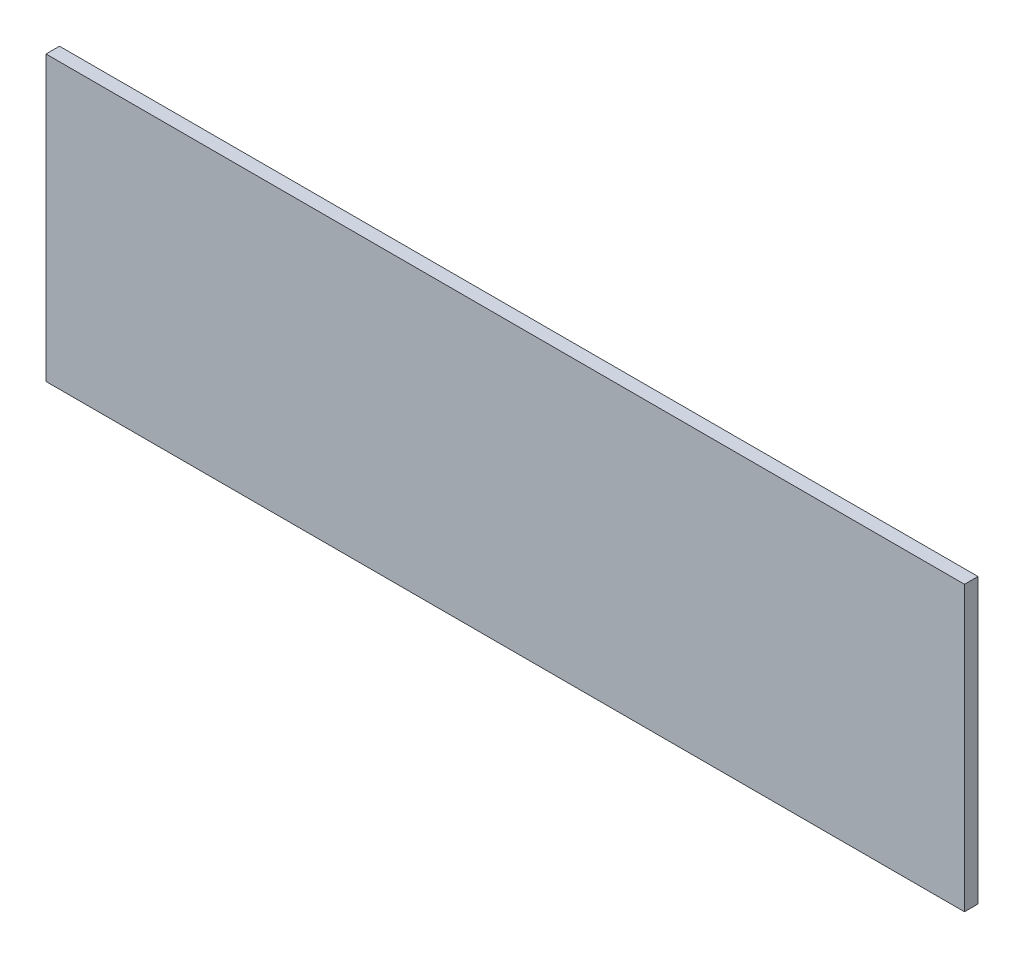
ISO-10303-21;
HEADER;
FILE_DESCRIPTION(('STEP AP214'),'2;1');
FILE_NAME('part.step','',(''),(''),'','','');
FILE_SCHEMA(('AUTOMOTIVE_DESIGN { 1 0 10303 214 1 1 1 1 }'));
ENDSEC;
DATA;
#1=APPLICATION_CONTEXT('core data for automotive mechanical design processes');
#2=APPLICATION_PROTOCOL_DEFINITION('international standard','automotive_design',2000,#1);
#3=PRODUCT_CONTEXT('',#1,'mechanical');
#4=PRODUCT('Part','Part','',(#3));
#5=PRODUCT_RELATED_PRODUCT_CATEGORY('part','',(#4));
#6=PRODUCT_DEFINITION_FORMATION('','',#4);
#7=PRODUCT_DEFINITION_CONTEXT('part definition',#1,'design');
#8=PRODUCT_DEFINITION('design','',#6,#7);
#9=PRODUCT_DEFINITION_SHAPE('','',#8);
#10=(LENGTH_UNIT() NAMED_UNIT(*) SI_UNIT(.MILLI.,.METRE.));
#11=(NAMED_UNIT(*) PLANE_ANGLE_UNIT() SI_UNIT($,.RADIAN.));
#12=(NAMED_UNIT(*) SI_UNIT($,.STERADIAN.) SOLID_ANGLE_UNIT());
#13=UNCERTAINTY_MEASURE_WITH_UNIT(LENGTH_MEASURE(1.E-05),#10,'distance_accuracy_value','');
#14=(GEOMETRIC_REPRESENTATION_CONTEXT(3) GLOBAL_UNCERTAINTY_ASSIGNED_CONTEXT((#13)) GLOBAL_UNIT_ASSIGNED_CONTEXT((#10,
#11,#12)) REPRESENTATION_CONTEXT('',''));
#15=CARTESIAN_POINT('',(0.,0.,0.));
#16=DIRECTION('',(0.,0.,1.));
#17=DIRECTION('',(1.,0.,0.));
#18=AXIS2_PLACEMENT_3D('',#15,#16,#17);
#19=CARTESIAN_POINT('',(-340.,105.,10.));
#20=DIRECTION('',(1.,0.,0.));
#21=DIRECTION('',(0.,0.,-1.));
#22=AXIS2_PLACEMENT_3D('',#19,#20,#21);
#23=PLANE('',#22);
#24=DIRECTION('',(0.,-1.,0.));
#25=VECTOR('',#24,1.);
#26=CARTESIAN_POINT('',(-340.,105.,0.));
#27=LINE('',#26,#25);
#28=CARTESIAN_POINT('',(-340.,105.,0.));
#29=VERTEX_POINT('',#28);
#30=CARTESIAN_POINT('',(-340.,-105.,0.));
#31=VERTEX_POINT('',#30);
#32=EDGE_CURVE('E96',#29,#31,#27,.T.);
#33=ORIENTED_EDGE('',*,*,#32,.T.);
#34=DIRECTION('',(0.,0.,-1.));
#35=VECTOR('',#34,1.);
#36=CARTESIAN_POINT('',(-340.,-105.,10.));
#37=LINE('',#36,#35);
#38=CARTESIAN_POINT('',(-340.,-105.,10.));
#39=VERTEX_POINT('',#38);
#40=EDGE_CURVE('E11',#39,#31,#37,.T.);
#41=ORIENTED_EDGE('',*,*,#40,.F.);
#42=DIRECTION('',(0.,-1.,0.));
#43=VECTOR('',#42,1.);
#44=CARTESIAN_POINT('',(-340.,105.,10.));
#45=LINE('',#44,#43);
#46=CARTESIAN_POINT('',(-340.,105.,10.));
#47=VERTEX_POINT('',#46);
#48=EDGE_CURVE('E84',#47,#39,#45,.T.);
#49=ORIENTED_EDGE('',*,*,#48,.F.);
#50=DIRECTION('',(0.,0.,-1.));
#51=VECTOR('',#50,1.);
#52=CARTESIAN_POINT('',(-340.,105.,10.));
#53=LINE('',#52,#51);
#54=EDGE_CURVE('E92',#47,#29,#53,.T.);
#55=ORIENTED_EDGE('',*,*,#54,.T.);
#56=EDGE_LOOP('',(#33,#41,#49,#55));
#57=FACE_BOUND('',#56,.T.);
#58=ADVANCED_FACE('F33',(#57),#23,.F.);
#59=CARTESIAN_POINT('',(-340.,-105.,10.));
#60=DIRECTION('',(0.,1.,0.));
#61=DIRECTION('',(0.,0.,1.));
#62=AXIS2_PLACEMENT_3D('',#59,#60,#61);
#63=PLANE('',#62);
#64=DIRECTION('',(1.,0.,0.));
#65=VECTOR('',#64,1.);
#66=CARTESIAN_POINT('',(-340.,-105.,0.));
#67=LINE('',#66,#65);
#68=CARTESIAN_POINT('',(340.,-105.,0.));
#69=VERTEX_POINT('',#68);
#70=EDGE_CURVE('E88',#31,#69,#67,.T.);
#71=ORIENTED_EDGE('',*,*,#70,.T.);
#72=DIRECTION('',(0.,0.,-1.));
#73=VECTOR('',#72,1.);
#74=CARTESIAN_POINT('',(340.,-105.,10.));
#75=LINE('',#74,#73);
#76=CARTESIAN_POINT('',(340.,-105.,10.));
#77=VERTEX_POINT('',#76);
#78=EDGE_CURVE('E41',#77,#69,#75,.T.);
#79=ORIENTED_EDGE('',*,*,#78,.F.);
#80=DIRECTION('',(1.,0.,0.));
#81=VECTOR('',#80,1.);
#82=CARTESIAN_POINT('',(-340.,-105.,10.));
#83=LINE('',#82,#81);
#84=EDGE_CURVE('E79',#39,#77,#83,.T.);
#85=ORIENTED_EDGE('',*,*,#84,.F.);
#86=ORIENTED_EDGE('',*,*,#40,.T.);
#87=EDGE_LOOP('',(#71,#79,#85,#86));
#88=FACE_BOUND('',#87,.T.);
#89=ADVANCED_FACE('F87',(#88),#63,.F.);
#90=CARTESIAN_POINT('',(340.,105.,10.));
#91=DIRECTION('',(-1.,0.,0.));
#92=DIRECTION('',(0.,0.,1.));
#93=AXIS2_PLACEMENT_3D('',#90,#91,#92);
#94=PLANE('',#93);
#95=DIRECTION('',(0.,1.,0.));
#96=VECTOR('',#95,1.);
#97=CARTESIAN_POINT('',(340.,105.,0.));
#98=LINE('',#97,#96);
#99=CARTESIAN_POINT('',(340.,105.,0.));
#100=VERTEX_POINT('',#99);
#101=EDGE_CURVE('E66',#69,#100,#98,.T.);
#102=ORIENTED_EDGE('',*,*,#101,.T.);
#103=DIRECTION('',(0.,0.,-1.));
#104=VECTOR('',#103,1.);
#105=CARTESIAN_POINT('',(340.,105.,10.));
#106=LINE('',#105,#104);
#107=CARTESIAN_POINT('',(340.,105.,10.));
#108=VERTEX_POINT('',#107);
#109=EDGE_CURVE('E89',#108,#100,#106,.T.);
#110=ORIENTED_EDGE('',*,*,#109,.F.);
#111=DIRECTION('',(0.,1.,0.));
#112=VECTOR('',#111,1.);
#113=CARTESIAN_POINT('',(340.,105.,10.));
#114=LINE('',#113,#112);
#115=EDGE_CURVE('E82',#77,#108,#114,.T.);
#116=ORIENTED_EDGE('',*,*,#115,.F.);
#117=ORIENTED_EDGE('',*,*,#78,.T.);
#118=EDGE_LOOP('',(#102,#110,#116,#117));
#119=FACE_BOUND('',#118,.T.);
#120=ADVANCED_FACE('F90',(#119),#94,.F.);
#121=CARTESIAN_POINT('',(-340.,105.,10.));
#122=DIRECTION('',(0.,-1.,0.));
#123=DIRECTION('',(0.,0.,-1.));
#124=AXIS2_PLACEMENT_3D('',#121,#122,#123);
#125=PLANE('',#124);
#126=DIRECTION('',(-1.,0.,0.));
#127=VECTOR('',#126,1.);
#128=CARTESIAN_POINT('',(-340.,105.,0.));
#129=LINE('',#128,#127);
#130=EDGE_CURVE('E72',#100,#29,#129,.T.);
#131=ORIENTED_EDGE('',*,*,#130,.T.);
#132=ORIENTED_EDGE('',*,*,#54,.F.);
#133=DIRECTION('',(-1.,0.,0.));
#134=VECTOR('',#133,1.);
#135=CARTESIAN_POINT('',(-340.,105.,10.));
#136=LINE('',#135,#134);
#137=EDGE_CURVE('E49',#108,#47,#136,.T.);
#138=ORIENTED_EDGE('',*,*,#137,.F.);
#139=ORIENTED_EDGE('',*,*,#109,.T.);
#140=EDGE_LOOP('',(#131,#132,#138,#139));
#141=FACE_BOUND('',#140,.T.);
#142=ADVANCED_FACE('F103',(#141),#125,.F.);
#143=CARTESIAN_POINT('',(0.,0.,10.));
#144=DIRECTION('',(0.,0.,1.));
#145=DIRECTION('',(1.,0.,0.));
#146=AXIS2_PLACEMENT_3D('',#143,#144,#145);
#147=PLANE('',#146);
#148=ORIENTED_EDGE('',*,*,#48,.T.);
#149=ORIENTED_EDGE('',*,*,#84,.T.);
#150=ORIENTED_EDGE('',*,*,#115,.T.);
#151=ORIENTED_EDGE('',*,*,#137,.T.);
#152=EDGE_LOOP('',(#148,#149,#150,#151));
#153=FACE_BOUND('',#152,.T.);
#154=ADVANCED_FACE('F80',(#153),#147,.T.);
#155=CARTESIAN_POINT('',(0.,0.,0.));
#156=DIRECTION('',(0.,0.,1.));
#157=DIRECTION('',(1.,0.,0.));
#158=AXIS2_PLACEMENT_3D('',#155,#156,#157);
#159=PLANE('',#158);
#160=ORIENTED_EDGE('',*,*,#32,.F.);
#161=ORIENTED_EDGE('',*,*,#130,.F.);
#162=ORIENTED_EDGE('',*,*,#101,.F.);
#163=ORIENTED_EDGE('',*,*,#70,.F.);
#164=EDGE_LOOP('',(#160,#161,#162,#163));
#165=FACE_BOUND('',#164,.T.);
#166=ADVANCED_FACE('F106',(#165),#159,.F.);
#167=CLOSED_SHELL('',(#58,#89,#120,#142,#154,#166));
#168=MANIFOLD_SOLID_BREP('B2',#167);
#169=ADVANCED_BREP_SHAPE_REPRESENTATION('',(#18,#168),#14);
#170=SHAPE_DEFINITION_REPRESENTATION(#9,#169);
ENDSEC;
END-ISO-10303-21;
